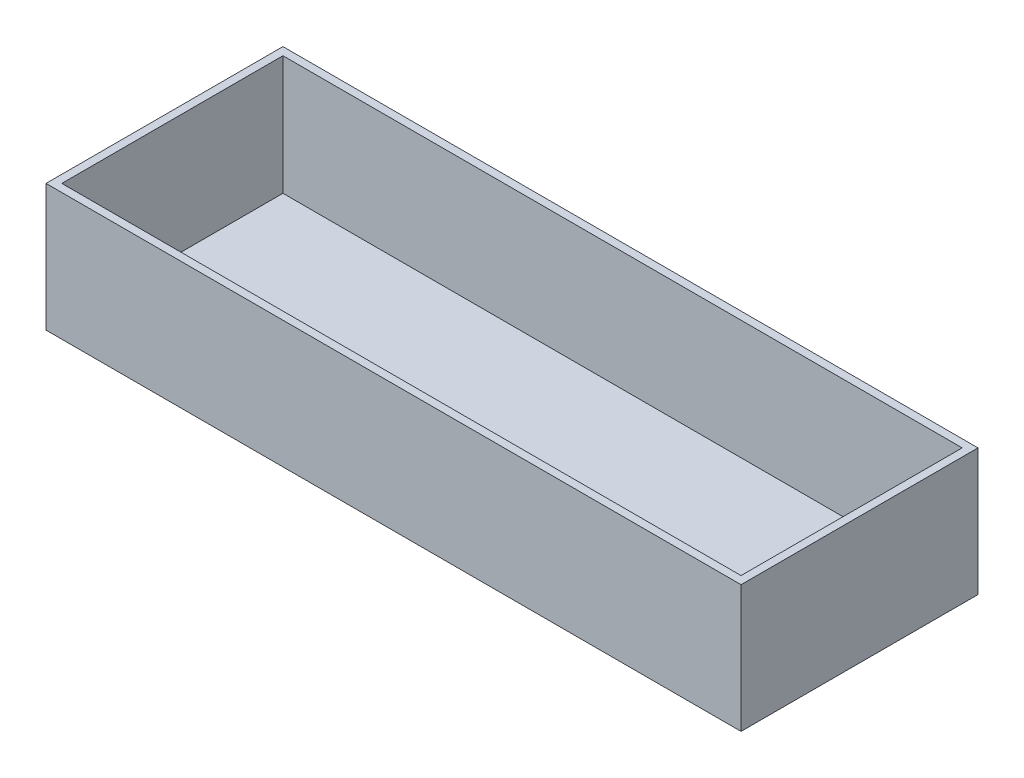
ISO-10303-21;
HEADER;
FILE_DESCRIPTION(('STEP AP214'),'2;1');
FILE_NAME('part.step','',(''),(''),'','','');
FILE_SCHEMA(('AUTOMOTIVE_DESIGN { 1 0 10303 214 1 1 1 1 }'));
ENDSEC;
DATA;
#1=APPLICATION_CONTEXT('core data for automotive mechanical design processes');
#2=APPLICATION_PROTOCOL_DEFINITION('international standard','automotive_design',2000,#1);
#3=PRODUCT_CONTEXT('',#1,'mechanical');
#4=PRODUCT('Part','Part','',(#3));
#5=PRODUCT_RELATED_PRODUCT_CATEGORY('part','',(#4));
#6=PRODUCT_DEFINITION_FORMATION('','',#4);
#7=PRODUCT_DEFINITION_CONTEXT('part definition',#1,'design');
#8=PRODUCT_DEFINITION('design','',#6,#7);
#9=PRODUCT_DEFINITION_SHAPE('','',#8);
#10=(LENGTH_UNIT() NAMED_UNIT(*) SI_UNIT(.MILLI.,.METRE.));
#11=(NAMED_UNIT(*) PLANE_ANGLE_UNIT() SI_UNIT($,.RADIAN.));
#12=(NAMED_UNIT(*) SI_UNIT($,.STERADIAN.) SOLID_ANGLE_UNIT());
#13=UNCERTAINTY_MEASURE_WITH_UNIT(LENGTH_MEASURE(1.E-05),#10,'distance_accuracy_value','');
#14=(GEOMETRIC_REPRESENTATION_CONTEXT(3) GLOBAL_UNCERTAINTY_ASSIGNED_CONTEXT((#13)) GLOBAL_UNIT_ASSIGNED_CONTEXT((#10,
#11,#12)) REPRESENTATION_CONTEXT('',''));
#15=CARTESIAN_POINT('',(0.,0.,0.));
#16=DIRECTION('',(0.,0.,1.));
#17=DIRECTION('',(1.,0.,0.));
#18=AXIS2_PLACEMENT_3D('',#15,#16,#17);
#19=CARTESIAN_POINT('',(139.7,3.175,47.625));
#20=DIRECTION('',(-1.,0.,0.));
#21=DIRECTION('',(0.,0.,1.));
#22=AXIS2_PLACEMENT_3D('',#19,#20,#21);
#23=PLANE('',#22);
#24=DIRECTION('',(0.,0.,-1.));
#25=VECTOR('',#24,1.);
#26=CARTESIAN_POINT('',(139.7,0.,47.625));
#27=LINE('',#26,#25);
#28=CARTESIAN_POINT('',(139.7,0.,47.625));
#29=VERTEX_POINT('',#28);
#30=CARTESIAN_POINT('',(139.7,0.,-47.625));
#31=VERTEX_POINT('',#30);
#32=EDGE_CURVE('E149',#29,#31,#27,.T.);
#33=ORIENTED_EDGE('',*,*,#32,.T.);
#34=DIRECTION('',(0.,-1.,0.));
#35=VECTOR('',#34,1.);
#36=CARTESIAN_POINT('',(139.7,3.175,-47.625));
#37=LINE('',#36,#35);
#38=CARTESIAN_POINT('',(139.7,51.0794,-47.625));
#39=VERTEX_POINT('',#38);
#40=EDGE_CURVE('E11',#39,#31,#37,.T.);
#41=ORIENTED_EDGE('',*,*,#40,.F.);
#42=DIRECTION('',(0.,0.,-1.));
#43=VECTOR('',#42,1.);
#44=CARTESIAN_POINT('',(139.7,51.0794,47.625));
#45=LINE('',#44,#43);
#46=CARTESIAN_POINT('',(139.7,51.0794,47.625));
#47=VERTEX_POINT('',#46);
#48=EDGE_CURVE('E140',#47,#39,#45,.T.);
#49=ORIENTED_EDGE('',*,*,#48,.F.);
#50=DIRECTION('',(0.,-1.,0.));
#51=VECTOR('',#50,1.);
#52=CARTESIAN_POINT('',(139.7,3.175,47.625));
#53=LINE('',#52,#51);
#54=EDGE_CURVE('E157',#47,#29,#53,.T.);
#55=ORIENTED_EDGE('',*,*,#54,.T.);
#56=EDGE_LOOP('',(#33,#41,#49,#55));
#57=FACE_BOUND('',#56,.T.);
#58=ADVANCED_FACE('F32',(#57),#23,.F.);
#59=CARTESIAN_POINT('',(-139.7,3.175,-47.625));
#60=DIRECTION('',(0.,0.,1.));
#61=DIRECTION('',(1.,0.,0.));
#62=AXIS2_PLACEMENT_3D('',#59,#60,#61);
#63=PLANE('',#62);
#64=DIRECTION('',(-1.,0.,0.));
#65=VECTOR('',#64,1.);
#66=CARTESIAN_POINT('',(-139.7,0.,-47.625));
#67=LINE('',#66,#65);
#68=CARTESIAN_POINT('',(-139.7,0.,-47.625));
#69=VERTEX_POINT('',#68);
#70=EDGE_CURVE('E152',#31,#69,#67,.T.);
#71=ORIENTED_EDGE('',*,*,#70,.T.);
#72=DIRECTION('',(0.,-1.,0.));
#73=VECTOR('',#72,1.);
#74=CARTESIAN_POINT('',(-139.7,3.175,-47.625));
#75=LINE('',#74,#73);
#76=CARTESIAN_POINT('',(-139.7,51.0794,-47.625));
#77=VERTEX_POINT('',#76);
#78=EDGE_CURVE('E39',#77,#69,#75,.T.);
#79=ORIENTED_EDGE('',*,*,#78,.F.);
#80=DIRECTION('',(-1.,0.,0.));
#81=VECTOR('',#80,1.);
#82=CARTESIAN_POINT('',(139.7,51.0794,-47.625));
#83=LINE('',#82,#81);
#84=EDGE_CURVE('E143',#39,#77,#83,.T.);
#85=ORIENTED_EDGE('',*,*,#84,.F.);
#86=ORIENTED_EDGE('',*,*,#40,.T.);
#87=EDGE_LOOP('',(#71,#79,#85,#86));
#88=FACE_BOUND('',#87,.T.);
#89=ADVANCED_FACE('F175',(#88),#63,.F.);
#90=CARTESIAN_POINT('',(-139.7,3.175,47.625));
#91=DIRECTION('',(1.,0.,0.));
#92=DIRECTION('',(0.,0.,-1.));
#93=AXIS2_PLACEMENT_3D('',#90,#91,#92);
#94=PLANE('',#93);
#95=DIRECTION('',(0.,0.,1.));
#96=VECTOR('',#95,1.);
#97=CARTESIAN_POINT('',(-139.7,0.,47.625));
#98=LINE('',#97,#96);
#99=CARTESIAN_POINT('',(-139.7,0.,47.625));
#100=VERTEX_POINT('',#99);
#101=EDGE_CURVE('E154',#69,#100,#98,.T.);
#102=ORIENTED_EDGE('',*,*,#101,.T.);
#103=DIRECTION('',(0.,-1.,0.));
#104=VECTOR('',#103,1.);
#105=CARTESIAN_POINT('',(-139.7,3.175,47.625));
#106=LINE('',#105,#104);
#107=CARTESIAN_POINT('',(-139.7,51.0794,47.625));
#108=VERTEX_POINT('',#107);
#109=EDGE_CURVE('E159',#108,#100,#106,.T.);
#110=ORIENTED_EDGE('',*,*,#109,.F.);
#111=DIRECTION('',(0.,0.,1.));
#112=VECTOR('',#111,1.);
#113=CARTESIAN_POINT('',(-139.7,51.0794,-47.625));
#114=LINE('',#113,#112);
#115=EDGE_CURVE('E146',#77,#108,#114,.T.);
#116=ORIENTED_EDGE('',*,*,#115,.F.);
#117=ORIENTED_EDGE('',*,*,#78,.T.);
#118=EDGE_LOOP('',(#102,#110,#116,#117));
#119=FACE_BOUND('',#118,.T.);
#120=ADVANCED_FACE('F164',(#119),#94,.F.);
#121=CARTESIAN_POINT('',(-139.7,3.175,47.625));
#122=DIRECTION('',(0.,0.,-1.));
#123=DIRECTION('',(-1.,0.,0.));
#124=AXIS2_PLACEMENT_3D('',#121,#122,#123);
#125=PLANE('',#124);
#126=DIRECTION('',(1.,0.,0.));
#127=VECTOR('',#126,1.);
#128=CARTESIAN_POINT('',(-139.7,0.,47.625));
#129=LINE('',#128,#127);
#130=EDGE_CURVE('E54',#100,#29,#129,.T.);
#131=ORIENTED_EDGE('',*,*,#130,.T.);
#132=ORIENTED_EDGE('',*,*,#54,.F.);
#133=DIRECTION('',(1.,0.,0.));
#134=VECTOR('',#133,1.);
#135=CARTESIAN_POINT('',(-139.7,51.0794,47.625));
#136=LINE('',#135,#134);
#137=EDGE_CURVE('E114',#108,#47,#136,.T.);
#138=ORIENTED_EDGE('',*,*,#137,.F.);
#139=ORIENTED_EDGE('',*,*,#109,.T.);
#140=EDGE_LOOP('',(#131,#132,#138,#139));
#141=FACE_BOUND('',#140,.T.);
#142=ADVANCED_FACE('F173',(#141),#125,.F.);
#143=CARTESIAN_POINT('',(139.7,0.,-47.625));
#144=DIRECTION('',(0.,-1.,0.));
#145=DIRECTION('',(0.,0.,-1.));
#146=AXIS2_PLACEMENT_3D('',#143,#144,#145);
#147=PLANE('',#146);
#148=ORIENTED_EDGE('',*,*,#32,.F.);
#149=ORIENTED_EDGE('',*,*,#130,.F.);
#150=ORIENTED_EDGE('',*,*,#101,.F.);
#151=ORIENTED_EDGE('',*,*,#70,.F.);
#152=EDGE_LOOP('',(#148,#149,#150,#151));
#153=FACE_BOUND('',#152,.T.);
#154=ADVANCED_FACE('F169',(#153),#147,.T.);
#155=CARTESIAN_POINT('',(139.7,51.0794,47.625));
#156=DIRECTION('',(0.,1.,0.));
#157=DIRECTION('',(0.,0.,1.));
#158=AXIS2_PLACEMENT_3D('',#155,#156,#157);
#159=PLANE('',#158);
#160=ORIENTED_EDGE('',*,*,#137,.T.);
#161=ORIENTED_EDGE('',*,*,#48,.T.);
#162=ORIENTED_EDGE('',*,*,#84,.T.);
#163=ORIENTED_EDGE('',*,*,#115,.T.);
#164=EDGE_LOOP('',(#160,#161,#162,#163));
#165=FACE_BOUND('',#164,.T.);
#166=DIRECTION('',(0.,0.,-1.));
#167=VECTOR('',#166,1.);
#168=CARTESIAN_POINT('',(136.525,51.0794,44.45));
#169=LINE('',#168,#167);
#170=CARTESIAN_POINT('',(136.525,51.0794,44.45));
#171=VERTEX_POINT('',#170);
#172=CARTESIAN_POINT('',(136.525,51.0794,-44.45));
#173=VERTEX_POINT('',#172);
#174=EDGE_CURVE('E106',#171,#173,#169,.T.);
#175=ORIENTED_EDGE('',*,*,#174,.F.);
#176=DIRECTION('',(1.,0.,0.));
#177=VECTOR('',#176,1.);
#178=CARTESIAN_POINT('',(-136.525,51.0794,44.45));
#179=LINE('',#178,#177);
#180=CARTESIAN_POINT('',(-136.525,51.0794,44.45));
#181=VERTEX_POINT('',#180);
#182=EDGE_CURVE('E98',#181,#171,#179,.T.);
#183=ORIENTED_EDGE('',*,*,#182,.F.);
#184=DIRECTION('',(0.,0.,1.));
#185=VECTOR('',#184,1.);
#186=CARTESIAN_POINT('',(-136.525,51.0794,-44.45));
#187=LINE('',#186,#185);
#188=CARTESIAN_POINT('',(-136.525,51.0794,-44.45));
#189=VERTEX_POINT('',#188);
#190=EDGE_CURVE('E122',#189,#181,#187,.T.);
#191=ORIENTED_EDGE('',*,*,#190,.F.);
#192=DIRECTION('',(-1.,0.,0.));
#193=VECTOR('',#192,1.);
#194=CARTESIAN_POINT('',(136.525,51.0794,-44.45));
#195=LINE('',#194,#193);
#196=EDGE_CURVE('E120',#173,#189,#195,.T.);
#197=ORIENTED_EDGE('',*,*,#196,.F.);
#198=EDGE_LOOP('',(#175,#183,#191,#197));
#199=FACE_BOUND('',#198,.T.);
#200=ADVANCED_FACE('F118',(#165,#199),#159,.T.);
#201=CARTESIAN_POINT('',(-136.525,51.0794,44.45));
#202=DIRECTION('',(0.,0.,-1.));
#203=DIRECTION('',(-1.,0.,0.));
#204=AXIS2_PLACEMENT_3D('',#201,#202,#203);
#205=PLANE('',#204);
#206=DIRECTION('',(1.,0.,0.));
#207=VECTOR('',#206,1.);
#208=CARTESIAN_POINT('',(-136.525,3.175,44.45));
#209=LINE('',#208,#207);
#210=CARTESIAN_POINT('',(-136.525,3.175,44.45));
#211=VERTEX_POINT('',#210);
#212=CARTESIAN_POINT('',(136.525,3.175,44.45));
#213=VERTEX_POINT('',#212);
#214=EDGE_CURVE('E126',#211,#213,#209,.T.);
#215=ORIENTED_EDGE('',*,*,#214,.F.);
#216=DIRECTION('',(0.,-1.,0.));
#217=VECTOR('',#216,1.);
#218=CARTESIAN_POINT('',(-136.525,51.0794,44.45));
#219=LINE('',#218,#217);
#220=EDGE_CURVE('E46',#181,#211,#219,.T.);
#221=ORIENTED_EDGE('',*,*,#220,.F.);
#222=ORIENTED_EDGE('',*,*,#182,.T.);
#223=DIRECTION('',(0.,-1.,0.));
#224=VECTOR('',#223,1.);
#225=CARTESIAN_POINT('',(136.525,51.0794,44.45));
#226=LINE('',#225,#224);
#227=EDGE_CURVE('E101',#171,#213,#226,.T.);
#228=ORIENTED_EDGE('',*,*,#227,.T.);
#229=EDGE_LOOP('',(#215,#221,#222,#228));
#230=FACE_BOUND('',#229,.T.);
#231=ADVANCED_FACE('F100',(#230),#205,.T.);
#232=CARTESIAN_POINT('',(136.525,51.0794,44.45));
#233=DIRECTION('',(-1.,0.,0.));
#234=DIRECTION('',(0.,0.,1.));
#235=AXIS2_PLACEMENT_3D('',#232,#233,#234);
#236=PLANE('',#235);
#237=DIRECTION('',(0.,0.,-1.));
#238=VECTOR('',#237,1.);
#239=CARTESIAN_POINT('',(136.525,3.175,44.45));
#240=LINE('',#239,#238);
#241=CARTESIAN_POINT('',(136.525,3.175,-44.45));
#242=VERTEX_POINT('',#241);
#243=EDGE_CURVE('E113',#213,#242,#240,.T.);
#244=ORIENTED_EDGE('',*,*,#243,.F.);
#245=ORIENTED_EDGE('',*,*,#227,.F.);
#246=ORIENTED_EDGE('',*,*,#174,.T.);
#247=DIRECTION('',(0.,-1.,0.));
#248=VECTOR('',#247,1.);
#249=CARTESIAN_POINT('',(136.525,51.0794,-44.45));
#250=LINE('',#249,#248);
#251=EDGE_CURVE('E115',#173,#242,#250,.T.);
#252=ORIENTED_EDGE('',*,*,#251,.T.);
#253=EDGE_LOOP('',(#244,#245,#246,#252));
#254=FACE_BOUND('',#253,.T.);
#255=ADVANCED_FACE('F110',(#254),#236,.T.);
#256=CARTESIAN_POINT('',(136.525,51.0794,-44.45));
#257=DIRECTION('',(0.,0.,1.));
#258=DIRECTION('',(1.,0.,0.));
#259=AXIS2_PLACEMENT_3D('',#256,#257,#258);
#260=PLANE('',#259);
#261=DIRECTION('',(-1.,0.,0.));
#262=VECTOR('',#261,1.);
#263=CARTESIAN_POINT('',(136.525,3.175,-44.45));
#264=LINE('',#263,#262);
#265=CARTESIAN_POINT('',(-136.525,3.175,-44.45));
#266=VERTEX_POINT('',#265);
#267=EDGE_CURVE('E129',#242,#266,#264,.T.);
#268=ORIENTED_EDGE('',*,*,#267,.F.);
#269=ORIENTED_EDGE('',*,*,#251,.F.);
#270=ORIENTED_EDGE('',*,*,#196,.T.);
#271=DIRECTION('',(0.,-1.,0.));
#272=VECTOR('',#271,1.);
#273=CARTESIAN_POINT('',(-136.525,51.0794,-44.45));
#274=LINE('',#273,#272);
#275=EDGE_CURVE('E135',#189,#266,#274,.T.);
#276=ORIENTED_EDGE('',*,*,#275,.T.);
#277=EDGE_LOOP('',(#268,#269,#270,#276));
#278=FACE_BOUND('',#277,.T.);
#279=ADVANCED_FACE('F198',(#278),#260,.T.);
#280=CARTESIAN_POINT('',(-136.525,51.0794,-44.45));
#281=DIRECTION('',(1.,0.,0.));
#282=DIRECTION('',(0.,0.,-1.));
#283=AXIS2_PLACEMENT_3D('',#280,#281,#282);
#284=PLANE('',#283);
#285=DIRECTION('',(0.,0.,1.));
#286=VECTOR('',#285,1.);
#287=CARTESIAN_POINT('',(-136.525,3.175,-44.45));
#288=LINE('',#287,#286);
#289=EDGE_CURVE('E107',#266,#211,#288,.T.);
#290=ORIENTED_EDGE('',*,*,#289,.F.);
#291=ORIENTED_EDGE('',*,*,#275,.F.);
#292=ORIENTED_EDGE('',*,*,#190,.T.);
#293=ORIENTED_EDGE('',*,*,#220,.T.);
#294=EDGE_LOOP('',(#290,#291,#292,#293));
#295=FACE_BOUND('',#294,.T.);
#296=ADVANCED_FACE('F190',(#295),#284,.T.);
#297=CARTESIAN_POINT('',(139.7,3.175,-47.625));
#298=DIRECTION('',(0.,-1.,0.));
#299=DIRECTION('',(0.,0.,-1.));
#300=AXIS2_PLACEMENT_3D('',#297,#298,#299);
#301=PLANE('',#300);
#302=ORIENTED_EDGE('',*,*,#289,.T.);
#303=ORIENTED_EDGE('',*,*,#214,.T.);
#304=ORIENTED_EDGE('',*,*,#243,.T.);
#305=ORIENTED_EDGE('',*,*,#267,.T.);
#306=EDGE_LOOP('',(#302,#303,#304,#305));
#307=FACE_BOUND('',#306,.T.);
#308=ADVANCED_FACE('F187',(#307),#301,.F.);
#309=CLOSED_SHELL('',(#58,#89,#120,#142,#154,#200,#231,#255,#279,#296,#308));
#310=MANIFOLD_SOLID_BREP('B2',#309);
#311=ADVANCED_BREP_SHAPE_REPRESENTATION('',(#18,#310),#14);
#312=SHAPE_DEFINITION_REPRESENTATION(#9,#311);
ENDSEC;
END-ISO-10303-21;
